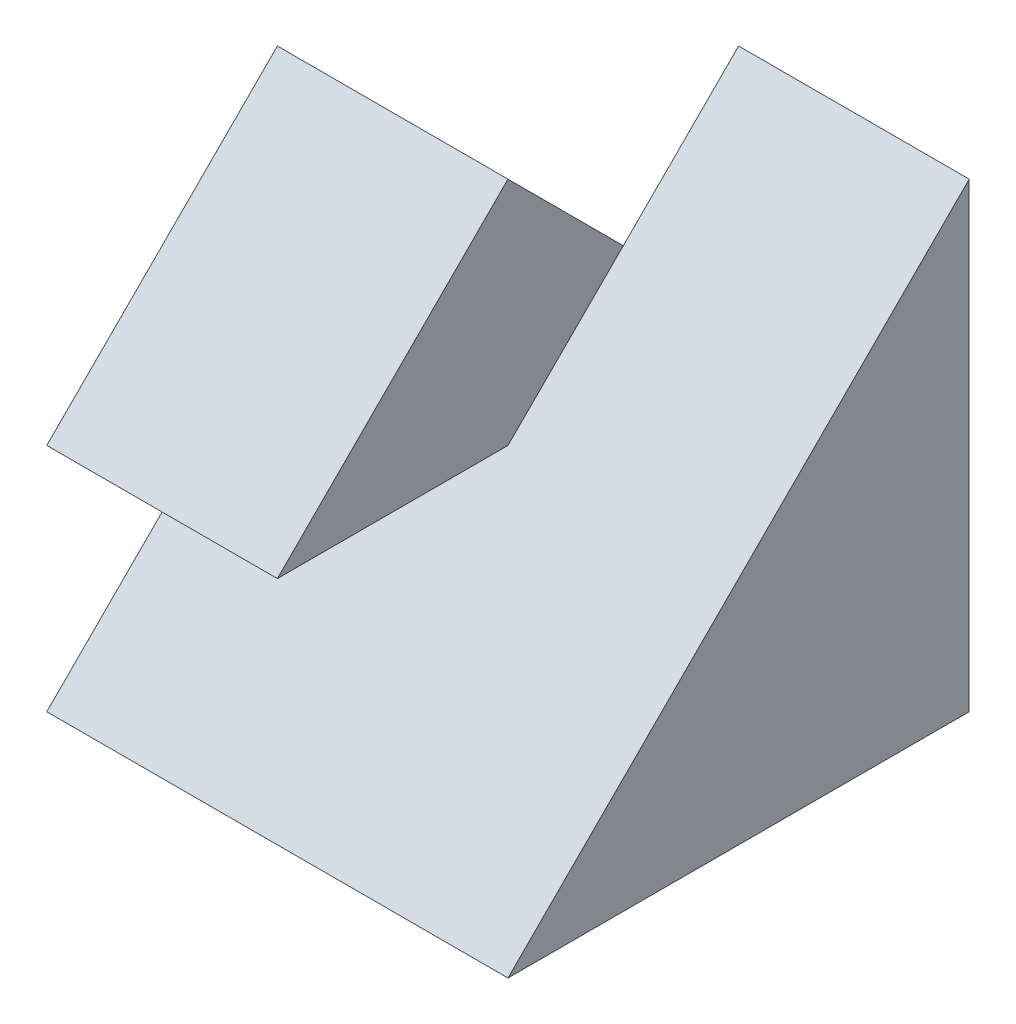
ISO-10303-21;
HEADER;
FILE_DESCRIPTION(('STEP AP214'),'2;1');
FILE_NAME('part.step','',(''),(''),'','','');
FILE_SCHEMA(('AUTOMOTIVE_DESIGN { 1 0 10303 214 1 1 1 1 }'));
ENDSEC;
DATA;
#1=APPLICATION_CONTEXT('core data for automotive mechanical design processes');
#2=APPLICATION_PROTOCOL_DEFINITION('international standard','automotive_design',2000,#1);
#3=PRODUCT_CONTEXT('',#1,'mechanical');
#4=PRODUCT('Part','Part','',(#3));
#5=PRODUCT_RELATED_PRODUCT_CATEGORY('part','',(#4));
#6=PRODUCT_DEFINITION_FORMATION('','',#4);
#7=PRODUCT_DEFINITION_CONTEXT('part definition',#1,'design');
#8=PRODUCT_DEFINITION('design','',#6,#7);
#9=PRODUCT_DEFINITION_SHAPE('','',#8);
#10=(LENGTH_UNIT() NAMED_UNIT(*) SI_UNIT(.MILLI.,.METRE.));
#11=(NAMED_UNIT(*) PLANE_ANGLE_UNIT() SI_UNIT($,.RADIAN.));
#12=(NAMED_UNIT(*) SI_UNIT($,.STERADIAN.) SOLID_ANGLE_UNIT());
#13=UNCERTAINTY_MEASURE_WITH_UNIT(LENGTH_MEASURE(1.E-05),#10,'distance_accuracy_value','');
#14=(GEOMETRIC_REPRESENTATION_CONTEXT(3) GLOBAL_UNCERTAINTY_ASSIGNED_CONTEXT((#13)) GLOBAL_UNIT_ASSIGNED_CONTEXT((#10,
#11,#12)) REPRESENTATION_CONTEXT('',''));
#15=CARTESIAN_POINT('',(0.,0.,0.));
#16=DIRECTION('',(0.,0.,1.));
#17=DIRECTION('',(1.,0.,0.));
#18=AXIS2_PLACEMENT_3D('',#15,#16,#17);
#19=CARTESIAN_POINT('',(-2.,4.,2.));
#20=DIRECTION('',(1.,0.,0.));
#21=DIRECTION('',(0.,0.,-1.));
#22=AXIS2_PLACEMENT_3D('',#19,#20,#21);
#23=PLANE('',#22);
#24=DIRECTION('',(0.,0.,1.));
#25=VECTOR('',#24,1.);
#26=CARTESIAN_POINT('',(-2.,1.99999999999998,0.));
#27=LINE('',#26,#25);
#28=CARTESIAN_POINT('',(-2.,1.99999999999998,0.));
#29=VERTEX_POINT('',#28);
#30=CARTESIAN_POINT('',(-2.,1.99999999999999,2.));
#31=VERTEX_POINT('',#30);
#32=EDGE_CURVE('E164',#29,#31,#27,.T.);
#33=ORIENTED_EDGE('',*,*,#32,.T.);
#34=DIRECTION('',(0.,0.707106781186548,-0.707106781186548));
#35=VECTOR('',#34,1.);
#36=CARTESIAN_POINT('',(-2.,2.,2.));
#37=LINE('',#36,#35);
#38=CARTESIAN_POINT('',(-2.,4.,0.));
#39=VERTEX_POINT('',#38);
#40=EDGE_CURVE('E171',#31,#39,#37,.T.);
#41=ORIENTED_EDGE('',*,*,#40,.T.);
#42=DIRECTION('',(0.,-0.707106781186548,-0.707106781186548));
#43=VECTOR('',#42,1.);
#44=CARTESIAN_POINT('',(-2.,4.,0.));
#45=LINE('',#44,#43);
#46=CARTESIAN_POINT('',(-2.,2.,-2.));
#47=VERTEX_POINT('',#46);
#48=EDGE_CURVE('E160',#39,#47,#45,.T.);
#49=ORIENTED_EDGE('',*,*,#48,.T.);
#50=DIRECTION('',(0.,-1.,0.));
#51=VECTOR('',#50,1.);
#52=CARTESIAN_POINT('',(-2.,4.,-2.));
#53=LINE('',#52,#51);
#54=CARTESIAN_POINT('',(-2.,0.,-2.));
#55=VERTEX_POINT('',#54);
#56=EDGE_CURVE('E76',#47,#55,#53,.T.);
#57=ORIENTED_EDGE('',*,*,#56,.T.);
#58=DIRECTION('',(0.,0.,1.));
#59=VECTOR('',#58,1.);
#60=CARTESIAN_POINT('',(-2.,0.,2.));
#61=LINE('',#60,#59);
#62=CARTESIAN_POINT('',(-2.,0.,2.));
#63=VERTEX_POINT('',#62);
#64=EDGE_CURVE('E177',#55,#63,#61,.T.);
#65=ORIENTED_EDGE('',*,*,#64,.T.);
#66=DIRECTION('',(0.,0.707106781186544,-0.707106781186551));
#67=VECTOR('',#66,1.);
#68=CARTESIAN_POINT('',(-2.,1.,0.999999999999989));
#69=LINE('',#68,#67);
#70=EDGE_CURVE('E181',#63,#29,#69,.T.);
#71=ORIENTED_EDGE('',*,*,#70,.T.);
#72=EDGE_LOOP('',(#33,#41,#49,#57,#65,#71));
#73=FACE_BOUND('',#72,.T.);
#74=ADVANCED_FACE('F68',(#73),#23,.F.);
#75=CARTESIAN_POINT('',(-2.,4.,-2.));
#76=DIRECTION('',(0.,0.,1.));
#77=DIRECTION('',(1.,0.,0.));
#78=AXIS2_PLACEMENT_3D('',#75,#76,#77);
#79=PLANE('',#78);
#80=DIRECTION('',(-1.,0.,0.));
#81=VECTOR('',#80,1.);
#82=CARTESIAN_POINT('',(0.,2.,-2.));
#83=LINE('',#82,#81);
#84=CARTESIAN_POINT('',(0.,2.,-2.));
#85=VERTEX_POINT('',#84);
#86=EDGE_CURVE('E153',#85,#47,#83,.T.);
#87=ORIENTED_EDGE('',*,*,#86,.F.);
#88=DIRECTION('',(0.,1.,0.));
#89=VECTOR('',#88,1.);
#90=CARTESIAN_POINT('',(0.,2.,-2.));
#91=LINE('',#90,#89);
#92=CARTESIAN_POINT('',(0.,4.,-2.));
#93=VERTEX_POINT('',#92);
#94=EDGE_CURVE('E146',#85,#93,#91,.T.);
#95=ORIENTED_EDGE('',*,*,#94,.T.);
#96=DIRECTION('',(-1.,0.,0.));
#97=VECTOR('',#96,1.);
#98=CARTESIAN_POINT('',(-2.,4.,-2.));
#99=LINE('',#98,#97);
#100=CARTESIAN_POINT('',(2.,4.,-2.));
#101=VERTEX_POINT('',#100);
#102=EDGE_CURVE('E130',#101,#93,#99,.T.);
#103=ORIENTED_EDGE('',*,*,#102,.F.);
#104=DIRECTION('',(0.,-1.,0.));
#105=VECTOR('',#104,1.);
#106=CARTESIAN_POINT('',(2.,4.,-2.));
#107=LINE('',#106,#105);
#108=CARTESIAN_POINT('',(2.,0.,-2.));
#109=VERTEX_POINT('',#108);
#110=EDGE_CURVE('E12',#101,#109,#107,.T.);
#111=ORIENTED_EDGE('',*,*,#110,.T.);
#112=DIRECTION('',(-1.,0.,0.));
#113=VECTOR('',#112,1.);
#114=CARTESIAN_POINT('',(-2.,0.,-2.));
#115=LINE('',#114,#113);
#116=EDGE_CURVE('E89',#109,#55,#115,.T.);
#117=ORIENTED_EDGE('',*,*,#116,.T.);
#118=ORIENTED_EDGE('',*,*,#56,.F.);
#119=EDGE_LOOP('',(#87,#95,#103,#111,#117,#118));
#120=FACE_BOUND('',#119,.T.);
#121=ADVANCED_FACE('F152',(#120),#79,.F.);
#122=CARTESIAN_POINT('',(2.,4.,2.));
#123=DIRECTION('',(-1.,0.,0.));
#124=DIRECTION('',(0.,0.,1.));
#125=AXIS2_PLACEMENT_3D('',#122,#123,#124);
#126=PLANE('',#125);
#127=ORIENTED_EDGE('',*,*,#110,.F.);
#128=DIRECTION('',(0.,0.707106781186548,-0.707106781186548));
#129=VECTOR('',#128,1.);
#130=CARTESIAN_POINT('',(2.,0.,2.));
#131=LINE('',#130,#129);
#132=CARTESIAN_POINT('',(2.,0.,2.));
#133=VERTEX_POINT('',#132);
#134=EDGE_CURVE('E136',#133,#101,#131,.T.);
#135=ORIENTED_EDGE('',*,*,#134,.F.);
#136=DIRECTION('',(0.,0.,-1.));
#137=VECTOR('',#136,1.);
#138=CARTESIAN_POINT('',(2.,0.,2.));
#139=LINE('',#138,#137);
#140=EDGE_CURVE('E167',#133,#109,#139,.T.);
#141=ORIENTED_EDGE('',*,*,#140,.T.);
#142=EDGE_LOOP('',(#127,#135,#141));
#143=FACE_BOUND('',#142,.T.);
#144=ADVANCED_FACE('F70',(#143),#126,.F.);
#145=CARTESIAN_POINT('',(0.,0.,0.));
#146=DIRECTION('',(0.,-1.,0.));
#147=DIRECTION('',(0.,0.,-1.));
#148=AXIS2_PLACEMENT_3D('',#145,#146,#147);
#149=PLANE('',#148);
#150=ORIENTED_EDGE('',*,*,#140,.F.);
#151=DIRECTION('',(1.,0.,0.));
#152=VECTOR('',#151,1.);
#153=CARTESIAN_POINT('',(-2.,0.,2.));
#154=LINE('',#153,#152);
#155=EDGE_CURVE('E140',#63,#133,#154,.T.);
#156=ORIENTED_EDGE('',*,*,#155,.F.);
#157=ORIENTED_EDGE('',*,*,#64,.F.);
#158=ORIENTED_EDGE('',*,*,#116,.F.);
#159=EDGE_LOOP('',(#150,#156,#157,#158));
#160=FACE_BOUND('',#159,.T.);
#161=ADVANCED_FACE('F184',(#160),#149,.T.);
#162=CARTESIAN_POINT('',(0.,2.,2.));
#163=DIRECTION('',(0.,0.707106781186547,0.707106781186547));
#164=DIRECTION('',(0.,-0.707106781186548,0.707106781186548));
#165=AXIS2_PLACEMENT_3D('',#162,#163,#164);
#166=PLANE('',#165);
#167=ORIENTED_EDGE('',*,*,#40,.F.);
#168=DIRECTION('',(-1.,0.,0.));
#169=VECTOR('',#168,1.);
#170=CARTESIAN_POINT('',(0.,1.99999999999999,2.));
#171=LINE('',#170,#169);
#172=CARTESIAN_POINT('',(0.,1.99999999999999,2.));
#173=VERTEX_POINT('',#172);
#174=EDGE_CURVE('E165',#173,#31,#171,.T.);
#175=ORIENTED_EDGE('',*,*,#174,.F.);
#176=DIRECTION('',(0.,0.707106781186548,-0.707106781186548));
#177=VECTOR('',#176,1.);
#178=CARTESIAN_POINT('',(0.,2.,2.));
#179=LINE('',#178,#177);
#180=CARTESIAN_POINT('',(0.,4.,0.));
#181=VERTEX_POINT('',#180);
#182=EDGE_CURVE('E168',#173,#181,#179,.T.);
#183=ORIENTED_EDGE('',*,*,#182,.T.);
#184=DIRECTION('',(-1.,0.,0.));
#185=VECTOR('',#184,1.);
#186=CARTESIAN_POINT('',(0.,4.,0.));
#187=LINE('',#186,#185);
#188=EDGE_CURVE('E157',#181,#39,#187,.T.);
#189=ORIENTED_EDGE('',*,*,#188,.T.);
#190=EDGE_LOOP('',(#167,#175,#183,#189));
#191=FACE_BOUND('',#190,.T.);
#192=ADVANCED_FACE('F186',(#191),#166,.T.);
#193=CARTESIAN_POINT('',(0.,4.,0.));
#194=DIRECTION('',(0.,0.707106781186547,-0.707106781186547));
#195=DIRECTION('',(0.,0.707106781186548,0.707106781186548));
#196=AXIS2_PLACEMENT_3D('',#193,#194,#195);
#197=PLANE('',#196);
#198=ORIENTED_EDGE('',*,*,#48,.F.);
#199=ORIENTED_EDGE('',*,*,#188,.F.);
#200=DIRECTION('',(0.,-0.707106781186548,-0.707106781186548));
#201=VECTOR('',#200,1.);
#202=CARTESIAN_POINT('',(0.,4.,0.));
#203=LINE('',#202,#201);
#204=CARTESIAN_POINT('',(0.,3.,-1.));
#205=VERTEX_POINT('',#204);
#206=EDGE_CURVE('E155',#181,#205,#203,.T.);
#207=ORIENTED_EDGE('',*,*,#206,.T.);
#208=EDGE_CURVE('E148',#205,#85,#203,.T.);
#209=ORIENTED_EDGE('',*,*,#208,.T.);
#210=ORIENTED_EDGE('',*,*,#86,.T.);
#211=EDGE_LOOP('',(#198,#199,#207,#209,#210));
#212=FACE_BOUND('',#211,.T.);
#213=ADVANCED_FACE('F193',(#212),#197,.T.);
#214=CARTESIAN_POINT('',(0.,0.,0.));
#215=DIRECTION('',(-1.,0.,0.));
#216=DIRECTION('',(0.,0.,1.));
#217=AXIS2_PLACEMENT_3D('',#214,#215,#216);
#218=PLANE('',#217);
#219=DIRECTION('',(0.,0.707106781186548,-0.707106781186548));
#220=VECTOR('',#219,1.);
#221=CARTESIAN_POINT('',(0.,0.,2.));
#222=LINE('',#221,#220);
#223=EDGE_CURVE('E133',#205,#93,#222,.T.);
#224=ORIENTED_EDGE('',*,*,#223,.T.);
#225=ORIENTED_EDGE('',*,*,#94,.F.);
#226=ORIENTED_EDGE('',*,*,#208,.F.);
#227=EDGE_LOOP('',(#224,#225,#226));
#228=FACE_BOUND('',#227,.T.);
#229=ADVANCED_FACE('F145',(#228),#218,.T.);
#230=CARTESIAN_POINT('',(0.,1.99999999999998,0.));
#231=DIRECTION('',(0.,-1.,0.));
#232=DIRECTION('',(0.,0.,-1.));
#233=AXIS2_PLACEMENT_3D('',#230,#231,#232);
#234=PLANE('',#233);
#235=ORIENTED_EDGE('',*,*,#32,.F.);
#236=DIRECTION('',(-1.,0.,0.));
#237=VECTOR('',#236,1.);
#238=CARTESIAN_POINT('',(0.,1.99999999999998,0.));
#239=LINE('',#238,#237);
#240=CARTESIAN_POINT('',(0.,1.99999999999998,0.));
#241=VERTEX_POINT('',#240);
#242=EDGE_CURVE('E215',#241,#29,#239,.T.);
#243=ORIENTED_EDGE('',*,*,#242,.F.);
#244=DIRECTION('',(0.,0.,1.));
#245=VECTOR('',#244,1.);
#246=CARTESIAN_POINT('',(0.,1.99999999999998,0.));
#247=LINE('',#246,#245);
#248=EDGE_CURVE('E214',#241,#173,#247,.T.);
#249=ORIENTED_EDGE('',*,*,#248,.T.);
#250=ORIENTED_EDGE('',*,*,#174,.T.);
#251=EDGE_LOOP('',(#235,#243,#249,#250));
#252=FACE_BOUND('',#251,.T.);
#253=ADVANCED_FACE('F219',(#252),#234,.T.);
#254=CARTESIAN_POINT('',(0.,1.,0.999999999999989));
#255=DIRECTION('',(0.,0.707106781186551,0.707106781186544));
#256=DIRECTION('',(0.,-0.707106781186544,0.707106781186551));
#257=AXIS2_PLACEMENT_3D('',#254,#255,#256);
#258=PLANE('',#257);
#259=ORIENTED_EDGE('',*,*,#70,.F.);
#260=ORIENTED_EDGE('',*,*,#155,.T.);
#261=ORIENTED_EDGE('',*,*,#134,.T.);
#262=ORIENTED_EDGE('',*,*,#102,.T.);
#263=ORIENTED_EDGE('',*,*,#223,.F.);
#264=EDGE_CURVE('E150',#241,#205,#222,.T.);
#265=ORIENTED_EDGE('',*,*,#264,.F.);
#266=ORIENTED_EDGE('',*,*,#242,.T.);
#267=EDGE_LOOP('',(#259,#260,#261,#262,#263,#265,#266));
#268=FACE_BOUND('',#267,.T.);
#269=ADVANCED_FACE('F132',(#268),#258,.T.);
#270=CARTESIAN_POINT('',(0.,0.,0.));
#271=DIRECTION('',(-1.,0.,0.));
#272=DIRECTION('',(0.,0.,1.));
#273=AXIS2_PLACEMENT_3D('',#270,#271,#272);
#274=PLANE('',#273);
#275=ORIENTED_EDGE('',*,*,#206,.F.);
#276=ORIENTED_EDGE('',*,*,#182,.F.);
#277=ORIENTED_EDGE('',*,*,#248,.F.);
#278=ORIENTED_EDGE('',*,*,#264,.T.);
#279=EDGE_LOOP('',(#275,#276,#277,#278));
#280=FACE_BOUND('',#279,.T.);
#281=ADVANCED_FACE('F211',(#280),#274,.F.);
#282=CLOSED_SHELL('',(#74,#121,#144,#161,#192,#213,#229,#253,#269,#281));
#283=MANIFOLD_SOLID_BREP('B2',#282);
#284=ADVANCED_BREP_SHAPE_REPRESENTATION('',(#18,#283),#14);
#285=SHAPE_DEFINITION_REPRESENTATION(#9,#284);
ENDSEC;
END-ISO-10303-21;
